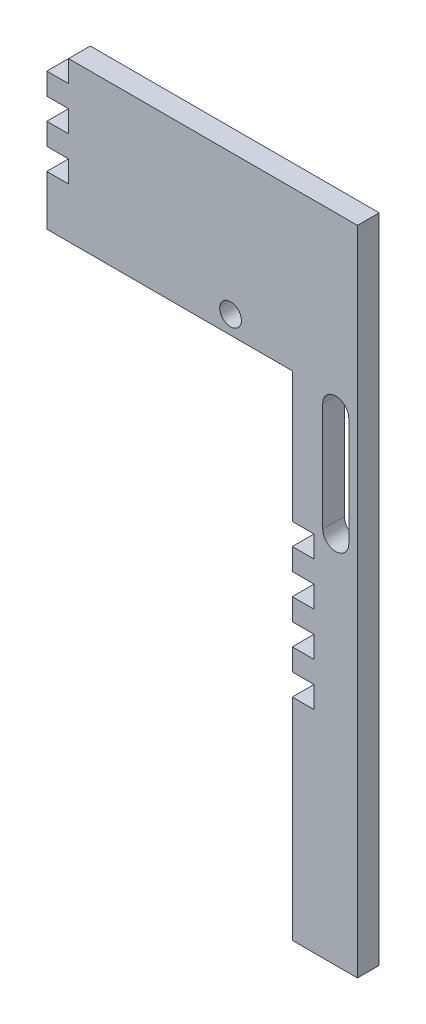
ISO-10303-21;
HEADER;
FILE_DESCRIPTION(('STEP AP214'),'2;1');
FILE_NAME('part.step','',(''),(''),'','','');
FILE_SCHEMA(('AUTOMOTIVE_DESIGN { 1 0 10303 214 1 1 1 1 }'));
ENDSEC;
DATA;
#1=APPLICATION_CONTEXT('core data for automotive mechanical design processes');
#2=APPLICATION_PROTOCOL_DEFINITION('international standard','automotive_design',2000,#1);
#3=PRODUCT_CONTEXT('',#1,'mechanical');
#4=PRODUCT('Part','Part','',(#3));
#5=PRODUCT_RELATED_PRODUCT_CATEGORY('part','',(#4));
#6=PRODUCT_DEFINITION_FORMATION('','',#4);
#7=PRODUCT_DEFINITION_CONTEXT('part definition',#1,'design');
#8=PRODUCT_DEFINITION('design','',#6,#7);
#9=PRODUCT_DEFINITION_SHAPE('','',#8);
#10=(LENGTH_UNIT() NAMED_UNIT(*) SI_UNIT(.MILLI.,.METRE.));
#11=(NAMED_UNIT(*) PLANE_ANGLE_UNIT() SI_UNIT($,.RADIAN.));
#12=(NAMED_UNIT(*) SI_UNIT($,.STERADIAN.) SOLID_ANGLE_UNIT());
#13=UNCERTAINTY_MEASURE_WITH_UNIT(LENGTH_MEASURE(1.E-05),#10,'distance_accuracy_value','');
#14=(GEOMETRIC_REPRESENTATION_CONTEXT(3) GLOBAL_UNCERTAINTY_ASSIGNED_CONTEXT((#13)) GLOBAL_UNIT_ASSIGNED_CONTEXT((#10,
#11,#12)) REPRESENTATION_CONTEXT('',''));
#15=CARTESIAN_POINT('',(0.,0.,0.));
#16=DIRECTION('',(0.,0.,1.));
#17=DIRECTION('',(1.,0.,0.));
#18=AXIS2_PLACEMENT_3D('',#15,#16,#17);
#19=CARTESIAN_POINT('',(-30.,0.,10.));
#20=DIRECTION('',(1.,0.,0.));
#21=DIRECTION('',(0.,0.,-1.));
#22=AXIS2_PLACEMENT_3D('',#19,#20,#21);
#23=PLANE('',#22);
#24=DIRECTION('',(0.,-1.,0.));
#25=VECTOR('',#24,1.);
#26=CARTESIAN_POINT('',(-30.,0.,0.));
#27=LINE('',#26,#25);
#28=CARTESIAN_POINT('',(-30.,117.,0.));
#29=VERTEX_POINT('',#28);
#30=CARTESIAN_POINT('',(-30.,107.,0.));
#31=VERTEX_POINT('',#30);
#32=EDGE_CURVE('E617',#29,#31,#27,.T.);
#33=ORIENTED_EDGE('',*,*,#32,.T.);
#34=DIRECTION('',(0.,0.,1.));
#35=VECTOR('',#34,1.);
#36=CARTESIAN_POINT('',(-30.,107.,0.));
#37=LINE('',#36,#35);
#38=CARTESIAN_POINT('',(-30.,107.,10.));
#39=VERTEX_POINT('',#38);
#40=EDGE_CURVE('E324',#31,#39,#37,.T.);
#41=ORIENTED_EDGE('',*,*,#40,.T.);
#42=DIRECTION('',(0.,-1.,0.));
#43=VECTOR('',#42,1.);
#44=CARTESIAN_POINT('',(-30.,0.,10.));
#45=LINE('',#44,#43);
#46=CARTESIAN_POINT('',(-30.,117.,10.));
#47=VERTEX_POINT('',#46);
#48=EDGE_CURVE('E635',#47,#39,#45,.T.);
#49=ORIENTED_EDGE('',*,*,#48,.F.);
#50=DIRECTION('',(0.,0.,1.));
#51=VECTOR('',#50,1.);
#52=CARTESIAN_POINT('',(-30.,117.,0.));
#53=LINE('',#52,#51);
#54=EDGE_CURVE('E343',#29,#47,#53,.T.);
#55=ORIENTED_EDGE('',*,*,#54,.F.);
#56=EDGE_LOOP('',(#33,#41,#49,#55));
#57=FACE_BOUND('',#56,.T.);
#58=ADVANCED_FACE('F33',(#57),#23,.F.);
#59=CARTESIAN_POINT('',(-30.,137.,0.));
#60=VERTEX_POINT('',#59);
#61=CARTESIAN_POINT('',(-30.,127.,0.));
#62=VERTEX_POINT('',#61);
#63=EDGE_CURVE('E615',#60,#62,#27,.T.);
#64=ORIENTED_EDGE('',*,*,#63,.T.);
#65=DIRECTION('',(0.,0.,1.));
#66=VECTOR('',#65,1.);
#67=CARTESIAN_POINT('',(-30.,127.,0.));
#68=LINE('',#67,#66);
#69=CARTESIAN_POINT('',(-30.,127.,10.));
#70=VERTEX_POINT('',#69);
#71=EDGE_CURVE('E350',#62,#70,#68,.T.);
#72=ORIENTED_EDGE('',*,*,#71,.T.);
#73=CARTESIAN_POINT('',(-30.,137.,10.));
#74=VERTEX_POINT('',#73);
#75=EDGE_CURVE('E637',#74,#70,#45,.T.);
#76=ORIENTED_EDGE('',*,*,#75,.F.);
#77=DIRECTION('',(0.,0.,1.));
#78=VECTOR('',#77,1.);
#79=CARTESIAN_POINT('',(-30.,137.,0.));
#80=LINE('',#79,#78);
#81=EDGE_CURVE('E369',#60,#74,#80,.T.);
#82=ORIENTED_EDGE('',*,*,#81,.F.);
#83=EDGE_LOOP('',(#64,#72,#76,#82));
#84=FACE_BOUND('',#83,.T.);
#85=ADVANCED_FACE('F585',(#84),#23,.F.);
#86=CARTESIAN_POINT('',(-30.,157.,0.));
#87=VERTEX_POINT('',#86);
#88=CARTESIAN_POINT('',(-30.,147.,0.));
#89=VERTEX_POINT('',#88);
#90=EDGE_CURVE('E519',#87,#89,#27,.T.);
#91=ORIENTED_EDGE('',*,*,#90,.T.);
#92=DIRECTION('',(0.,0.,1.));
#93=VECTOR('',#92,1.);
#94=CARTESIAN_POINT('',(-30.,147.,0.));
#95=LINE('',#94,#93);
#96=CARTESIAN_POINT('',(-30.,147.,10.));
#97=VERTEX_POINT('',#96);
#98=EDGE_CURVE('E376',#89,#97,#95,.T.);
#99=ORIENTED_EDGE('',*,*,#98,.T.);
#100=CARTESIAN_POINT('',(-30.,157.,10.));
#101=VERTEX_POINT('',#100);
#102=EDGE_CURVE('E500',#101,#97,#45,.T.);
#103=ORIENTED_EDGE('',*,*,#102,.F.);
#104=DIRECTION('',(0.,0.,1.));
#105=VECTOR('',#104,1.);
#106=CARTESIAN_POINT('',(-30.,157.,0.));
#107=LINE('',#106,#105);
#108=EDGE_CURVE('E395',#87,#101,#107,.T.);
#109=ORIENTED_EDGE('',*,*,#108,.F.);
#110=EDGE_LOOP('',(#91,#99,#103,#109));
#111=FACE_BOUND('',#110,.T.);
#112=ADVANCED_FACE('F591',(#111),#23,.F.);
#113=CARTESIAN_POINT('',(-30.,227.,0.));
#114=VERTEX_POINT('',#113);
#115=CARTESIAN_POINT('',(-30.,167.,0.));
#116=VERTEX_POINT('',#115);
#117=EDGE_CURVE('E516',#114,#116,#27,.T.);
#118=ORIENTED_EDGE('',*,*,#117,.T.);
#119=DIRECTION('',(0.,0.,1.));
#120=VECTOR('',#119,1.);
#121=CARTESIAN_POINT('',(-30.,167.,0.));
#122=LINE('',#121,#120);
#123=CARTESIAN_POINT('',(-30.,167.,10.));
#124=VERTEX_POINT('',#123);
#125=EDGE_CURVE('E402',#116,#124,#122,.T.);
#126=ORIENTED_EDGE('',*,*,#125,.T.);
#127=CARTESIAN_POINT('',(-30.,227.,10.));
#128=VERTEX_POINT('',#127);
#129=EDGE_CURVE('E496',#128,#124,#45,.T.);
#130=ORIENTED_EDGE('',*,*,#129,.F.);
#131=DIRECTION('',(0.,0.,-1.));
#132=VECTOR('',#131,1.);
#133=CARTESIAN_POINT('',(-30.,227.,10.));
#134=LINE('',#133,#132);
#135=EDGE_CURVE('E526',#128,#114,#134,.T.);
#136=ORIENTED_EDGE('',*,*,#135,.T.);
#137=EDGE_LOOP('',(#118,#126,#130,#136));
#138=FACE_BOUND('',#137,.T.);
#139=ADVANCED_FACE('F541',(#138),#23,.F.);
#140=CARTESIAN_POINT('',(-143.,227.,10.));
#141=DIRECTION('',(1.,0.,0.));
#142=DIRECTION('',(0.,1.,0.));
#143=AXIS2_PLACEMENT_3D('',#140,#141,#142);
#144=PLANE('',#143);
#145=DIRECTION('',(0.,-1.,0.));
#146=VECTOR('',#145,1.);
#147=CARTESIAN_POINT('',(-143.,227.,0.));
#148=LINE('',#147,#146);
#149=CARTESIAN_POINT('',(-143.,270.,0.));
#150=VERTEX_POINT('',#149);
#151=CARTESIAN_POINT('',(-143.,260.,0.));
#152=VERTEX_POINT('',#151);
#153=EDGE_CURVE('E513',#150,#152,#148,.T.);
#154=ORIENTED_EDGE('',*,*,#153,.T.);
#155=DIRECTION('',(0.,0.,1.));
#156=VECTOR('',#155,1.);
#157=CARTESIAN_POINT('',(-143.,260.,0.));
#158=LINE('',#157,#156);
#159=CARTESIAN_POINT('',(-143.,260.,10.));
#160=VERTEX_POINT('',#159);
#161=EDGE_CURVE('E428',#152,#160,#158,.T.);
#162=ORIENTED_EDGE('',*,*,#161,.T.);
#163=DIRECTION('',(0.,-1.,0.));
#164=VECTOR('',#163,1.);
#165=CARTESIAN_POINT('',(-143.,227.,10.));
#166=LINE('',#165,#164);
#167=CARTESIAN_POINT('',(-143.,270.,10.));
#168=VERTEX_POINT('',#167);
#169=EDGE_CURVE('E493',#168,#160,#166,.T.);
#170=ORIENTED_EDGE('',*,*,#169,.F.);
#171=DIRECTION('',(0.,0.,1.));
#172=VECTOR('',#171,1.);
#173=CARTESIAN_POINT('',(-143.,270.,0.));
#174=LINE('',#173,#172);
#175=EDGE_CURVE('E447',#150,#168,#174,.T.);
#176=ORIENTED_EDGE('',*,*,#175,.F.);
#177=EDGE_LOOP('',(#154,#162,#170,#176));
#178=FACE_BOUND('',#177,.T.);
#179=ADVANCED_FACE('F559',(#178),#144,.F.);
#180=CARTESIAN_POINT('',(-143.,290.,0.));
#181=VERTEX_POINT('',#180);
#182=CARTESIAN_POINT('',(-143.,280.,0.));
#183=VERTEX_POINT('',#182);
#184=EDGE_CURVE('E509',#181,#183,#148,.T.);
#185=ORIENTED_EDGE('',*,*,#184,.T.);
#186=DIRECTION('',(0.,0.,1.));
#187=VECTOR('',#186,1.);
#188=CARTESIAN_POINT('',(-143.,280.,0.));
#189=LINE('',#188,#187);
#190=CARTESIAN_POINT('',(-143.,280.,10.));
#191=VERTEX_POINT('',#190);
#192=EDGE_CURVE('E454',#183,#191,#189,.T.);
#193=ORIENTED_EDGE('',*,*,#192,.T.);
#194=CARTESIAN_POINT('',(-143.,290.,10.));
#195=VERTEX_POINT('',#194);
#196=EDGE_CURVE('E489',#195,#191,#166,.T.);
#197=ORIENTED_EDGE('',*,*,#196,.F.);
#198=DIRECTION('',(0.,0.,1.));
#199=VECTOR('',#198,1.);
#200=CARTESIAN_POINT('',(-143.,290.,0.));
#201=LINE('',#200,#199);
#202=EDGE_CURVE('E470',#181,#195,#201,.T.);
#203=ORIENTED_EDGE('',*,*,#202,.F.);
#204=EDGE_LOOP('',(#185,#193,#197,#203));
#205=FACE_BOUND('',#204,.T.);
#206=ADVANCED_FACE('F573',(#205),#144,.F.);
#207=CARTESIAN_POINT('',(0.,0.,10.));
#208=DIRECTION('',(-1.,0.,0.));
#209=DIRECTION('',(0.,0.,1.));
#210=AXIS2_PLACEMENT_3D('',#207,#208,#209);
#211=PLANE('',#210);
#212=DIRECTION('',(0.,1.,0.));
#213=VECTOR('',#212,1.);
#214=CARTESIAN_POINT('',(0.,0.,0.));
#215=LINE('',#214,#213);
#216=CARTESIAN_POINT('',(0.,0.,0.));
#217=VERTEX_POINT('',#216);
#218=CARTESIAN_POINT('',(0.,300.,0.));
#219=VERTEX_POINT('',#218);
#220=EDGE_CURVE('E477',#217,#219,#215,.T.);
#221=ORIENTED_EDGE('',*,*,#220,.T.);
#222=DIRECTION('',(0.,0.,-1.));
#223=VECTOR('',#222,1.);
#224=CARTESIAN_POINT('',(0.,300.,10.));
#225=LINE('',#224,#223);
#226=CARTESIAN_POINT('',(0.,300.,10.));
#227=VERTEX_POINT('',#226);
#228=EDGE_CURVE('E11',#227,#219,#225,.T.);
#229=ORIENTED_EDGE('',*,*,#228,.F.);
#230=DIRECTION('',(0.,1.,0.));
#231=VECTOR('',#230,1.);
#232=CARTESIAN_POINT('',(0.,0.,10.));
#233=LINE('',#232,#231);
#234=CARTESIAN_POINT('',(0.,0.,10.));
#235=VERTEX_POINT('',#234);
#236=EDGE_CURVE('E481',#235,#227,#233,.T.);
#237=ORIENTED_EDGE('',*,*,#236,.F.);
#238=DIRECTION('',(0.,0.,-1.));
#239=VECTOR('',#238,1.);
#240=CARTESIAN_POINT('',(0.,0.,10.));
#241=LINE('',#240,#239);
#242=EDGE_CURVE('E502',#235,#217,#241,.T.);
#243=ORIENTED_EDGE('',*,*,#242,.T.);
#244=EDGE_LOOP('',(#221,#229,#237,#243));
#245=FACE_BOUND('',#244,.T.);
#246=ADVANCED_FACE('F35',(#245),#211,.F.);
#247=CARTESIAN_POINT('',(0.,300.,10.));
#248=DIRECTION('',(0.,-1.,0.));
#249=DIRECTION('',(0.,0.,-1.));
#250=AXIS2_PLACEMENT_3D('',#247,#248,#249);
#251=PLANE('',#250);
#252=DIRECTION('',(-1.,0.,0.));
#253=VECTOR('',#252,1.);
#254=CARTESIAN_POINT('',(0.,300.,0.));
#255=LINE('',#254,#253);
#256=CARTESIAN_POINT('',(-133.,300.,0.));
#257=VERTEX_POINT('',#256);
#258=EDGE_CURVE('E505',#219,#257,#255,.T.);
#259=ORIENTED_EDGE('',*,*,#258,.T.);
#260=DIRECTION('',(0.,0.,1.));
#261=VECTOR('',#260,1.);
#262=CARTESIAN_POINT('',(-133.,300.,0.));
#263=LINE('',#262,#261);
#264=CARTESIAN_POINT('',(-133.,300.,10.));
#265=VERTEX_POINT('',#264);
#266=EDGE_CURVE('E474',#257,#265,#263,.T.);
#267=ORIENTED_EDGE('',*,*,#266,.T.);
#268=DIRECTION('',(-1.,0.,0.));
#269=VECTOR('',#268,1.);
#270=CARTESIAN_POINT('',(0.,300.,10.));
#271=LINE('',#270,#269);
#272=EDGE_CURVE('E484',#227,#265,#271,.T.);
#273=ORIENTED_EDGE('',*,*,#272,.F.);
#274=ORIENTED_EDGE('',*,*,#228,.T.);
#275=EDGE_LOOP('',(#259,#267,#273,#274));
#276=FACE_BOUND('',#275,.T.);
#277=ADVANCED_FACE('F571',(#276),#251,.F.);
#278=CARTESIAN_POINT('',(-143.,250.,10.));
#279=VERTEX_POINT('',#278);
#280=CARTESIAN_POINT('',(-143.,227.,10.));
#281=VERTEX_POINT('',#280);
#282=EDGE_CURVE('E488',#279,#281,#166,.T.);
#283=ORIENTED_EDGE('',*,*,#282,.F.);
#284=DIRECTION('',(0.,0.,1.));
#285=VECTOR('',#284,1.);
#286=CARTESIAN_POINT('',(-143.,250.,0.));
#287=LINE('',#286,#285);
#288=CARTESIAN_POINT('',(-143.,250.,0.));
#289=VERTEX_POINT('',#288);
#290=EDGE_CURVE('E421',#289,#279,#287,.T.);
#291=ORIENTED_EDGE('',*,*,#290,.F.);
#292=CARTESIAN_POINT('',(-143.,227.,0.));
#293=VERTEX_POINT('',#292);
#294=EDGE_CURVE('E508',#289,#293,#148,.T.);
#295=ORIENTED_EDGE('',*,*,#294,.T.);
#296=DIRECTION('',(0.,0.,-1.));
#297=VECTOR('',#296,1.);
#298=CARTESIAN_POINT('',(-143.,227.,10.));
#299=LINE('',#298,#297);
#300=EDGE_CURVE('E41',#281,#293,#299,.T.);
#301=ORIENTED_EDGE('',*,*,#300,.F.);
#302=EDGE_LOOP('',(#283,#291,#295,#301));
#303=FACE_BOUND('',#302,.T.);
#304=ADVANCED_FACE('F569',(#303),#144,.F.);
#305=CARTESIAN_POINT('',(-30.,227.,10.));
#306=DIRECTION('',(0.,1.,0.));
#307=DIRECTION('',(0.,0.,1.));
#308=AXIS2_PLACEMENT_3D('',#305,#306,#307);
#309=PLANE('',#308);
#310=DIRECTION('',(1.,0.,0.));
#311=VECTOR('',#310,1.);
#312=CARTESIAN_POINT('',(-30.,227.,0.));
#313=LINE('',#312,#311);
#314=EDGE_CURVE('E512',#293,#114,#313,.T.);
#315=ORIENTED_EDGE('',*,*,#314,.T.);
#316=ORIENTED_EDGE('',*,*,#135,.F.);
#317=DIRECTION('',(1.,0.,0.));
#318=VECTOR('',#317,1.);
#319=CARTESIAN_POINT('',(-30.,227.,10.));
#320=LINE('',#319,#318);
#321=EDGE_CURVE('E492',#281,#128,#320,.T.);
#322=ORIENTED_EDGE('',*,*,#321,.F.);
#323=ORIENTED_EDGE('',*,*,#300,.T.);
#324=EDGE_LOOP('',(#315,#316,#322,#323));
#325=FACE_BOUND('',#324,.T.);
#326=ADVANCED_FACE('F533',(#325),#309,.F.);
#327=CARTESIAN_POINT('',(-30.,97.,10.));
#328=VERTEX_POINT('',#327);
#329=CARTESIAN_POINT('',(-30.,0.,10.));
#330=VERTEX_POINT('',#329);
#331=EDGE_CURVE('E495',#328,#330,#45,.T.);
#332=ORIENTED_EDGE('',*,*,#331,.F.);
#333=DIRECTION('',(0.,0.,1.));
#334=VECTOR('',#333,1.);
#335=CARTESIAN_POINT('',(-30.,97.,0.));
#336=LINE('',#335,#334);
#337=CARTESIAN_POINT('',(-30.,97.,0.));
#338=VERTEX_POINT('',#337);
#339=EDGE_CURVE('E317',#338,#328,#336,.T.);
#340=ORIENTED_EDGE('',*,*,#339,.F.);
#341=CARTESIAN_POINT('',(-30.,0.,0.));
#342=VERTEX_POINT('',#341);
#343=EDGE_CURVE('E515',#338,#342,#27,.T.);
#344=ORIENTED_EDGE('',*,*,#343,.T.);
#345=DIRECTION('',(0.,0.,-1.));
#346=VECTOR('',#345,1.);
#347=CARTESIAN_POINT('',(-30.,0.,10.));
#348=LINE('',#347,#346);
#349=EDGE_CURVE('E523',#330,#342,#348,.T.);
#350=ORIENTED_EDGE('',*,*,#349,.F.);
#351=EDGE_LOOP('',(#332,#340,#344,#350));
#352=FACE_BOUND('',#351,.T.);
#353=ADVANCED_FACE('F578',(#352),#23,.F.);
#354=CARTESIAN_POINT('',(0.,0.,10.));
#355=DIRECTION('',(0.,1.,0.));
#356=DIRECTION('',(-1.,0.,0.));
#357=AXIS2_PLACEMENT_3D('',#354,#355,#356);
#358=PLANE('',#357);
#359=DIRECTION('',(1.,0.,0.));
#360=VECTOR('',#359,1.);
#361=CARTESIAN_POINT('',(0.,0.,0.));
#362=LINE('',#361,#360);
#363=EDGE_CURVE('E485',#342,#217,#362,.T.);
#364=ORIENTED_EDGE('',*,*,#363,.T.);
#365=ORIENTED_EDGE('',*,*,#242,.F.);
#366=DIRECTION('',(1.,0.,0.));
#367=VECTOR('',#366,1.);
#368=CARTESIAN_POINT('',(0.,0.,10.));
#369=LINE('',#368,#367);
#370=EDGE_CURVE('E499',#330,#235,#369,.T.);
#371=ORIENTED_EDGE('',*,*,#370,.F.);
#372=ORIENTED_EDGE('',*,*,#349,.T.);
#373=EDGE_LOOP('',(#364,#365,#371,#372));
#374=FACE_BOUND('',#373,.T.);
#375=ADVANCED_FACE('F596',(#374),#358,.F.);
#376=CARTESIAN_POINT('',(0.,0.,10.));
#377=DIRECTION('',(0.,0.,1.));
#378=DIRECTION('',(1.,0.,0.));
#379=AXIS2_PLACEMENT_3D('',#376,#377,#378);
#380=PLANE('',#379);
#381=CARTESIAN_POINT('',(-58.4159264927315,235.370461513675,10.));
#382=DIRECTION('',(0.,0.,1.));
#383=DIRECTION('',(1.,0.,0.));
#384=AXIS2_PLACEMENT_3D('',#381,#382,#383);
#385=CIRCLE('',#384,5.);
#386=CARTESIAN_POINT('',(-53.4159264927315,235.370461513675,10.));
#387=VERTEX_POINT('',#386);
#388=EDGE_CURVE('E290',#387,#387,#385,.T.);
#389=ORIENTED_EDGE('',*,*,#388,.F.);
#390=EDGE_LOOP('',(#389));
#391=FACE_BOUND('',#390,.T.);
#392=CARTESIAN_POINT('',(-10.,221.,10.));
#393=DIRECTION('',(0.,0.,1.));
#394=DIRECTION('',(-1.,0.,0.));
#395=AXIS2_PLACEMENT_3D('',#392,#393,#394);
#396=CIRCLE('',#395,5.99999999999999);
#397=CARTESIAN_POINT('',(-4.,221.,10.));
#398=VERTEX_POINT('',#397);
#399=CARTESIAN_POINT('',(-16.,221.,10.));
#400=VERTEX_POINT('',#399);
#401=EDGE_CURVE('E48',#398,#400,#396,.T.);
#402=ORIENTED_EDGE('',*,*,#401,.F.);
#403=DIRECTION('',(0.,1.,0.));
#404=VECTOR('',#403,1.);
#405=CARTESIAN_POINT('',(-4.,221.,10.));
#406=LINE('',#405,#404);
#407=CARTESIAN_POINT('',(-3.99999999999999,171.,10.));
#408=VERTEX_POINT('',#407);
#409=EDGE_CURVE('E284',#408,#398,#406,.T.);
#410=ORIENTED_EDGE('',*,*,#409,.F.);
#411=CARTESIAN_POINT('',(-9.99999999999999,171.,10.));
#412=DIRECTION('',(0.,0.,1.));
#413=DIRECTION('',(1.,0.,0.));
#414=AXIS2_PLACEMENT_3D('',#411,#412,#413);
#415=CIRCLE('',#414,6.);
#416=CARTESIAN_POINT('',(-16.,171.,10.));
#417=VERTEX_POINT('',#416);
#418=EDGE_CURVE('E287',#417,#408,#415,.T.);
#419=ORIENTED_EDGE('',*,*,#418,.F.);
#420=DIRECTION('',(0.,-1.,0.));
#421=VECTOR('',#420,1.);
#422=CARTESIAN_POINT('',(-16.,171.,10.));
#423=LINE('',#422,#421);
#424=EDGE_CURVE('E296',#400,#417,#423,.T.);
#425=ORIENTED_EDGE('',*,*,#424,.F.);
#426=EDGE_LOOP('',(#402,#410,#419,#425));
#427=FACE_BOUND('',#426,.T.);
#428=DIRECTION('',(-1.,0.,0.));
#429=VECTOR('',#428,1.);
#430=CARTESIAN_POINT('',(-30.,107.,10.));
#431=LINE('',#430,#429);
#432=CARTESIAN_POINT('',(-20.,107.,10.));
#433=VERTEX_POINT('',#432);
#434=EDGE_CURVE('E311',#433,#39,#431,.T.);
#435=ORIENTED_EDGE('',*,*,#434,.F.);
#436=DIRECTION('',(0.,1.,0.));
#437=VECTOR('',#436,1.);
#438=CARTESIAN_POINT('',(-20.,107.,10.));
#439=LINE('',#438,#437);
#440=CARTESIAN_POINT('',(-20.,97.,10.));
#441=VERTEX_POINT('',#440);
#442=EDGE_CURVE('E320',#441,#433,#439,.T.);
#443=ORIENTED_EDGE('',*,*,#442,.F.);
#444=DIRECTION('',(1.,0.,0.));
#445=VECTOR('',#444,1.);
#446=CARTESIAN_POINT('',(-30.,97.,10.));
#447=LINE('',#446,#445);
#448=EDGE_CURVE('E303',#328,#441,#447,.T.);
#449=ORIENTED_EDGE('',*,*,#448,.F.);
#450=ORIENTED_EDGE('',*,*,#331,.T.);
#451=ORIENTED_EDGE('',*,*,#370,.T.);
#452=ORIENTED_EDGE('',*,*,#236,.T.);
#453=ORIENTED_EDGE('',*,*,#272,.T.);
#454=DIRECTION('',(0.,1.,0.));
#455=VECTOR('',#454,1.);
#456=CARTESIAN_POINT('',(-133.,300.,10.));
#457=LINE('',#456,#455);
#458=CARTESIAN_POINT('',(-133.,290.,10.));
#459=VERTEX_POINT('',#458);
#460=EDGE_CURVE('E467',#459,#265,#457,.T.);
#461=ORIENTED_EDGE('',*,*,#460,.F.);
#462=DIRECTION('',(1.,0.,0.));
#463=VECTOR('',#462,1.);
#464=CARTESIAN_POINT('',(-143.,290.,10.));
#465=LINE('',#464,#463);
#466=EDGE_CURVE('E457',#195,#459,#465,.T.);
#467=ORIENTED_EDGE('',*,*,#466,.F.);
#468=ORIENTED_EDGE('',*,*,#196,.T.);
#469=DIRECTION('',(-1.,0.,0.));
#470=VECTOR('',#469,1.);
#471=CARTESIAN_POINT('',(-143.,280.,10.));
#472=LINE('',#471,#470);
#473=CARTESIAN_POINT('',(-133.,280.,10.));
#474=VERTEX_POINT('',#473);
#475=EDGE_CURVE('E441',#474,#191,#472,.T.);
#476=ORIENTED_EDGE('',*,*,#475,.F.);
#477=DIRECTION('',(0.,1.,0.));
#478=VECTOR('',#477,1.);
#479=CARTESIAN_POINT('',(-133.,280.,10.));
#480=LINE('',#479,#478);
#481=CARTESIAN_POINT('',(-133.,270.,10.));
#482=VERTEX_POINT('',#481);
#483=EDGE_CURVE('E450',#482,#474,#480,.T.);
#484=ORIENTED_EDGE('',*,*,#483,.F.);
#485=DIRECTION('',(1.,0.,0.));
#486=VECTOR('',#485,1.);
#487=CARTESIAN_POINT('',(-143.,270.,10.));
#488=LINE('',#487,#486);
#489=EDGE_CURVE('E431',#168,#482,#488,.T.);
#490=ORIENTED_EDGE('',*,*,#489,.F.);
#491=ORIENTED_EDGE('',*,*,#169,.T.);
#492=DIRECTION('',(-1.,0.,0.));
#493=VECTOR('',#492,1.);
#494=CARTESIAN_POINT('',(-143.,260.,10.));
#495=LINE('',#494,#493);
#496=CARTESIAN_POINT('',(-133.,260.,10.));
#497=VERTEX_POINT('',#496);
#498=EDGE_CURVE('E415',#497,#160,#495,.T.);
#499=ORIENTED_EDGE('',*,*,#498,.F.);
#500=DIRECTION('',(0.,1.,0.));
#501=VECTOR('',#500,1.);
#502=CARTESIAN_POINT('',(-133.,260.,10.));
#503=LINE('',#502,#501);
#504=CARTESIAN_POINT('',(-133.,250.,10.));
#505=VERTEX_POINT('',#504);
#506=EDGE_CURVE('E424',#505,#497,#503,.T.);
#507=ORIENTED_EDGE('',*,*,#506,.F.);
#508=DIRECTION('',(1.,0.,0.));
#509=VECTOR('',#508,1.);
#510=CARTESIAN_POINT('',(-143.,250.,10.));
#511=LINE('',#510,#509);
#512=EDGE_CURVE('E405',#279,#505,#511,.T.);
#513=ORIENTED_EDGE('',*,*,#512,.F.);
#514=ORIENTED_EDGE('',*,*,#282,.T.);
#515=ORIENTED_EDGE('',*,*,#321,.T.);
#516=ORIENTED_EDGE('',*,*,#129,.T.);
#517=DIRECTION('',(-1.,0.,0.));
#518=VECTOR('',#517,1.);
#519=CARTESIAN_POINT('',(-30.,167.,10.));
#520=LINE('',#519,#518);
#521=CARTESIAN_POINT('',(-20.,167.,10.));
#522=VERTEX_POINT('',#521);
#523=EDGE_CURVE('E389',#522,#124,#520,.T.);
#524=ORIENTED_EDGE('',*,*,#523,.F.);
#525=DIRECTION('',(0.,1.,0.));
#526=VECTOR('',#525,1.);
#527=CARTESIAN_POINT('',(-20.,167.,10.));
#528=LINE('',#527,#526);
#529=CARTESIAN_POINT('',(-20.,157.,10.));
#530=VERTEX_POINT('',#529);
#531=EDGE_CURVE('E398',#530,#522,#528,.T.);
#532=ORIENTED_EDGE('',*,*,#531,.F.);
#533=DIRECTION('',(1.,0.,0.));
#534=VECTOR('',#533,1.);
#535=CARTESIAN_POINT('',(-30.,157.,10.));
#536=LINE('',#535,#534);
#537=EDGE_CURVE('E379',#101,#530,#536,.T.);
#538=ORIENTED_EDGE('',*,*,#537,.F.);
#539=ORIENTED_EDGE('',*,*,#102,.T.);
#540=DIRECTION('',(-1.,0.,0.));
#541=VECTOR('',#540,1.);
#542=CARTESIAN_POINT('',(-30.,147.,10.));
#543=LINE('',#542,#541);
#544=CARTESIAN_POINT('',(-20.,147.,10.));
#545=VERTEX_POINT('',#544);
#546=EDGE_CURVE('E363',#545,#97,#543,.T.);
#547=ORIENTED_EDGE('',*,*,#546,.F.);
#548=DIRECTION('',(0.,1.,0.));
#549=VECTOR('',#548,1.);
#550=CARTESIAN_POINT('',(-20.,147.,10.));
#551=LINE('',#550,#549);
#552=CARTESIAN_POINT('',(-20.,137.,10.));
#553=VERTEX_POINT('',#552);
#554=EDGE_CURVE('E372',#553,#545,#551,.T.);
#555=ORIENTED_EDGE('',*,*,#554,.F.);
#556=DIRECTION('',(1.,0.,0.));
#557=VECTOR('',#556,1.);
#558=CARTESIAN_POINT('',(-30.,137.,10.));
#559=LINE('',#558,#557);
#560=EDGE_CURVE('E353',#74,#553,#559,.T.);
#561=ORIENTED_EDGE('',*,*,#560,.F.);
#562=ORIENTED_EDGE('',*,*,#75,.T.);
#563=DIRECTION('',(-1.,0.,0.));
#564=VECTOR('',#563,1.);
#565=CARTESIAN_POINT('',(-30.,127.,10.));
#566=LINE('',#565,#564);
#567=CARTESIAN_POINT('',(-20.,127.,10.));
#568=VERTEX_POINT('',#567);
#569=EDGE_CURVE('E337',#568,#70,#566,.T.);
#570=ORIENTED_EDGE('',*,*,#569,.F.);
#571=DIRECTION('',(0.,1.,0.));
#572=VECTOR('',#571,1.);
#573=CARTESIAN_POINT('',(-20.,127.,10.));
#574=LINE('',#573,#572);
#575=CARTESIAN_POINT('',(-20.,117.,10.));
#576=VERTEX_POINT('',#575);
#577=EDGE_CURVE('E346',#576,#568,#574,.T.);
#578=ORIENTED_EDGE('',*,*,#577,.F.);
#579=DIRECTION('',(1.,0.,0.));
#580=VECTOR('',#579,1.);
#581=CARTESIAN_POINT('',(-30.,117.,10.));
#582=LINE('',#581,#580);
#583=EDGE_CURVE('E327',#47,#576,#582,.T.);
#584=ORIENTED_EDGE('',*,*,#583,.F.);
#585=ORIENTED_EDGE('',*,*,#48,.T.);
#586=EDGE_LOOP('',(#435,#443,#449,#450,#451,#452,#453,#461,#467,#468,#476,#484,#490,#491,#499,
#507,#513,#514,#515,#516,#524,#532,#538,#539,#547,#555,#561,#562,#570,#578,#584,#585));
#587=FACE_BOUND('',#586,.T.);
#588=ADVANCED_FACE('F546',(#391,#427,#587),#380,.T.);
#589=CARTESIAN_POINT('',(0.,0.,0.));
#590=DIRECTION('',(0.,0.,1.));
#591=DIRECTION('',(1.,0.,0.));
#592=AXIS2_PLACEMENT_3D('',#589,#590,#591);
#593=PLANE('',#592);
#594=CARTESIAN_POINT('',(-58.4159264927315,235.370461513675,0.));
#595=DIRECTION('',(0.,0.,1.));
#596=DIRECTION('',(1.,0.,0.));
#597=AXIS2_PLACEMENT_3D('',#594,#595,#596);
#598=CIRCLE('',#597,5.);
#599=CARTESIAN_POINT('',(-53.4159264927315,235.370461513675,0.));
#600=VERTEX_POINT('',#599);
#601=EDGE_CURVE('E297',#600,#600,#598,.T.);
#602=ORIENTED_EDGE('',*,*,#601,.T.);
#603=EDGE_LOOP('',(#602));
#604=FACE_BOUND('',#603,.T.);
#605=DIRECTION('',(0.,1.,0.));
#606=VECTOR('',#605,1.);
#607=CARTESIAN_POINT('',(-4.,221.,0.));
#608=LINE('',#607,#606);
#609=CARTESIAN_POINT('',(-3.99999999999999,171.,0.));
#610=VERTEX_POINT('',#609);
#611=CARTESIAN_POINT('',(-4.,221.,0.));
#612=VERTEX_POINT('',#611);
#613=EDGE_CURVE('E274',#610,#612,#608,.T.);
#614=ORIENTED_EDGE('',*,*,#613,.T.);
#615=CARTESIAN_POINT('',(-10.,221.,0.));
#616=DIRECTION('',(0.,0.,1.));
#617=DIRECTION('',(-1.,0.,0.));
#618=AXIS2_PLACEMENT_3D('',#615,#616,#617);
#619=CIRCLE('',#618,5.99999999999999);
#620=CARTESIAN_POINT('',(-16.,221.,0.));
#621=VERTEX_POINT('',#620);
#622=EDGE_CURVE('E268',#612,#621,#619,.T.);
#623=ORIENTED_EDGE('',*,*,#622,.T.);
#624=DIRECTION('',(0.,-1.,0.));
#625=VECTOR('',#624,1.);
#626=CARTESIAN_POINT('',(-16.,171.,0.));
#627=LINE('',#626,#625);
#628=CARTESIAN_POINT('',(-16.,171.,0.));
#629=VERTEX_POINT('',#628);
#630=EDGE_CURVE('E277',#621,#629,#627,.T.);
#631=ORIENTED_EDGE('',*,*,#630,.T.);
#632=CARTESIAN_POINT('',(-9.99999999999999,171.,0.));
#633=DIRECTION('',(0.,0.,1.));
#634=DIRECTION('',(1.,0.,0.));
#635=AXIS2_PLACEMENT_3D('',#632,#633,#634);
#636=CIRCLE('',#635,6.);
#637=EDGE_CURVE('E56',#629,#610,#636,.T.);
#638=ORIENTED_EDGE('',*,*,#637,.T.);
#639=EDGE_LOOP('',(#614,#623,#631,#638));
#640=FACE_BOUND('',#639,.T.);
#641=DIRECTION('',(0.,1.,0.));
#642=VECTOR('',#641,1.);
#643=CARTESIAN_POINT('',(-20.,107.,0.));
#644=LINE('',#643,#642);
#645=CARTESIAN_POINT('',(-20.,97.,0.));
#646=VERTEX_POINT('',#645);
#647=CARTESIAN_POINT('',(-20.,107.,0.));
#648=VERTEX_POINT('',#647);
#649=EDGE_CURVE('E310',#646,#648,#644,.T.);
#650=ORIENTED_EDGE('',*,*,#649,.T.);
#651=DIRECTION('',(-1.,0.,0.));
#652=VECTOR('',#651,1.);
#653=CARTESIAN_POINT('',(-30.,107.,0.));
#654=LINE('',#653,#652);
#655=EDGE_CURVE('E314',#648,#31,#654,.T.);
#656=ORIENTED_EDGE('',*,*,#655,.T.);
#657=ORIENTED_EDGE('',*,*,#32,.F.);
#658=DIRECTION('',(1.,0.,0.));
#659=VECTOR('',#658,1.);
#660=CARTESIAN_POINT('',(-30.,117.,0.));
#661=LINE('',#660,#659);
#662=CARTESIAN_POINT('',(-20.,117.,0.));
#663=VERTEX_POINT('',#662);
#664=EDGE_CURVE('E333',#29,#663,#661,.T.);
#665=ORIENTED_EDGE('',*,*,#664,.T.);
#666=DIRECTION('',(0.,1.,0.));
#667=VECTOR('',#666,1.);
#668=CARTESIAN_POINT('',(-20.,127.,0.));
#669=LINE('',#668,#667);
#670=CARTESIAN_POINT('',(-20.,127.,0.));
#671=VERTEX_POINT('',#670);
#672=EDGE_CURVE('E336',#663,#671,#669,.T.);
#673=ORIENTED_EDGE('',*,*,#672,.T.);
#674=DIRECTION('',(-1.,0.,0.));
#675=VECTOR('',#674,1.);
#676=CARTESIAN_POINT('',(-30.,127.,0.));
#677=LINE('',#676,#675);
#678=EDGE_CURVE('E340',#671,#62,#677,.T.);
#679=ORIENTED_EDGE('',*,*,#678,.T.);
#680=ORIENTED_EDGE('',*,*,#63,.F.);
#681=DIRECTION('',(1.,0.,0.));
#682=VECTOR('',#681,1.);
#683=CARTESIAN_POINT('',(-30.,137.,0.));
#684=LINE('',#683,#682);
#685=CARTESIAN_POINT('',(-20.,137.,0.));
#686=VERTEX_POINT('',#685);
#687=EDGE_CURVE('E359',#60,#686,#684,.T.);
#688=ORIENTED_EDGE('',*,*,#687,.T.);
#689=DIRECTION('',(0.,1.,0.));
#690=VECTOR('',#689,1.);
#691=CARTESIAN_POINT('',(-20.,147.,0.));
#692=LINE('',#691,#690);
#693=CARTESIAN_POINT('',(-20.,147.,0.));
#694=VERTEX_POINT('',#693);
#695=EDGE_CURVE('E362',#686,#694,#692,.T.);
#696=ORIENTED_EDGE('',*,*,#695,.T.);
#697=DIRECTION('',(-1.,0.,0.));
#698=VECTOR('',#697,1.);
#699=CARTESIAN_POINT('',(-30.,147.,0.));
#700=LINE('',#699,#698);
#701=EDGE_CURVE('E366',#694,#89,#700,.T.);
#702=ORIENTED_EDGE('',*,*,#701,.T.);
#703=ORIENTED_EDGE('',*,*,#90,.F.);
#704=DIRECTION('',(1.,0.,0.));
#705=VECTOR('',#704,1.);
#706=CARTESIAN_POINT('',(-30.,157.,0.));
#707=LINE('',#706,#705);
#708=CARTESIAN_POINT('',(-20.,157.,0.));
#709=VERTEX_POINT('',#708);
#710=EDGE_CURVE('E385',#87,#709,#707,.T.);
#711=ORIENTED_EDGE('',*,*,#710,.T.);
#712=DIRECTION('',(0.,1.,0.));
#713=VECTOR('',#712,1.);
#714=CARTESIAN_POINT('',(-20.,167.,0.));
#715=LINE('',#714,#713);
#716=CARTESIAN_POINT('',(-20.,167.,0.));
#717=VERTEX_POINT('',#716);
#718=EDGE_CURVE('E388',#709,#717,#715,.T.);
#719=ORIENTED_EDGE('',*,*,#718,.T.);
#720=DIRECTION('',(-1.,0.,0.));
#721=VECTOR('',#720,1.);
#722=CARTESIAN_POINT('',(-30.,167.,0.));
#723=LINE('',#722,#721);
#724=EDGE_CURVE('E392',#717,#116,#723,.T.);
#725=ORIENTED_EDGE('',*,*,#724,.T.);
#726=ORIENTED_EDGE('',*,*,#117,.F.);
#727=ORIENTED_EDGE('',*,*,#314,.F.);
#728=ORIENTED_EDGE('',*,*,#294,.F.);
#729=DIRECTION('',(1.,0.,0.));
#730=VECTOR('',#729,1.);
#731=CARTESIAN_POINT('',(-143.,250.,0.));
#732=LINE('',#731,#730);
#733=CARTESIAN_POINT('',(-133.,250.,0.));
#734=VERTEX_POINT('',#733);
#735=EDGE_CURVE('E411',#289,#734,#732,.T.);
#736=ORIENTED_EDGE('',*,*,#735,.T.);
#737=DIRECTION('',(0.,1.,0.));
#738=VECTOR('',#737,1.);
#739=CARTESIAN_POINT('',(-133.,260.,0.));
#740=LINE('',#739,#738);
#741=CARTESIAN_POINT('',(-133.,260.,0.));
#742=VERTEX_POINT('',#741);
#743=EDGE_CURVE('E414',#734,#742,#740,.T.);
#744=ORIENTED_EDGE('',*,*,#743,.T.);
#745=DIRECTION('',(-1.,0.,0.));
#746=VECTOR('',#745,1.);
#747=CARTESIAN_POINT('',(-143.,260.,0.));
#748=LINE('',#747,#746);
#749=EDGE_CURVE('E418',#742,#152,#748,.T.);
#750=ORIENTED_EDGE('',*,*,#749,.T.);
#751=ORIENTED_EDGE('',*,*,#153,.F.);
#752=DIRECTION('',(1.,0.,0.));
#753=VECTOR('',#752,1.);
#754=CARTESIAN_POINT('',(-143.,270.,0.));
#755=LINE('',#754,#753);
#756=CARTESIAN_POINT('',(-133.,270.,0.));
#757=VERTEX_POINT('',#756);
#758=EDGE_CURVE('E437',#150,#757,#755,.T.);
#759=ORIENTED_EDGE('',*,*,#758,.T.);
#760=DIRECTION('',(0.,1.,0.));
#761=VECTOR('',#760,1.);
#762=CARTESIAN_POINT('',(-133.,280.,0.));
#763=LINE('',#762,#761);
#764=CARTESIAN_POINT('',(-133.,280.,0.));
#765=VERTEX_POINT('',#764);
#766=EDGE_CURVE('E440',#757,#765,#763,.T.);
#767=ORIENTED_EDGE('',*,*,#766,.T.);
#768=DIRECTION('',(-1.,0.,0.));
#769=VECTOR('',#768,1.);
#770=CARTESIAN_POINT('',(-143.,280.,0.));
#771=LINE('',#770,#769);
#772=EDGE_CURVE('E444',#765,#183,#771,.T.);
#773=ORIENTED_EDGE('',*,*,#772,.T.);
#774=ORIENTED_EDGE('',*,*,#184,.F.);
#775=DIRECTION('',(1.,0.,0.));
#776=VECTOR('',#775,1.);
#777=CARTESIAN_POINT('',(-143.,290.,0.));
#778=LINE('',#777,#776);
#779=CARTESIAN_POINT('',(-133.,290.,0.));
#780=VERTEX_POINT('',#779);
#781=EDGE_CURVE('E463',#181,#780,#778,.T.);
#782=ORIENTED_EDGE('',*,*,#781,.T.);
#783=DIRECTION('',(0.,1.,0.));
#784=VECTOR('',#783,1.);
#785=CARTESIAN_POINT('',(-133.,300.,0.));
#786=LINE('',#785,#784);
#787=EDGE_CURVE('E466',#780,#257,#786,.T.);
#788=ORIENTED_EDGE('',*,*,#787,.T.);
#789=ORIENTED_EDGE('',*,*,#258,.F.);
#790=ORIENTED_EDGE('',*,*,#220,.F.);
#791=ORIENTED_EDGE('',*,*,#363,.F.);
#792=ORIENTED_EDGE('',*,*,#343,.F.);
#793=DIRECTION('',(1.,0.,0.));
#794=VECTOR('',#793,1.);
#795=CARTESIAN_POINT('',(-30.,97.,0.));
#796=LINE('',#795,#794);
#797=EDGE_CURVE('E307',#338,#646,#796,.T.);
#798=ORIENTED_EDGE('',*,*,#797,.T.);
#799=EDGE_LOOP('',(#650,#656,#657,#665,#673,#679,#680,#688,#696,#702,#703,#711,#719,#725,#726,
#727,#728,#736,#744,#750,#751,#759,#767,#773,#774,#782,#788,#789,#790,#791,#792,#798));
#800=FACE_BOUND('',#799,.T.);
#801=ADVANCED_FACE('F281',(#604,#640,#800),#593,.F.);
#802=CARTESIAN_POINT('',(-133.,300.,0.));
#803=DIRECTION('',(1.,0.,0.));
#804=DIRECTION('',(0.,0.,-1.));
#805=AXIS2_PLACEMENT_3D('',#802,#803,#804);
#806=PLANE('',#805);
#807=ORIENTED_EDGE('',*,*,#460,.T.);
#808=ORIENTED_EDGE('',*,*,#266,.F.);
#809=ORIENTED_EDGE('',*,*,#787,.F.);
#810=DIRECTION('',(0.,0.,1.));
#811=VECTOR('',#810,1.);
#812=CARTESIAN_POINT('',(-133.,290.,0.));
#813=LINE('',#812,#811);
#814=EDGE_CURVE('E478',#780,#459,#813,.T.);
#815=ORIENTED_EDGE('',*,*,#814,.T.);
#816=EDGE_LOOP('',(#807,#808,#809,#815));
#817=FACE_BOUND('',#816,.T.);
#818=ADVANCED_FACE('F686',(#817),#806,.F.);
#819=CARTESIAN_POINT('',(-143.,290.,0.));
#820=DIRECTION('',(0.,-1.,0.));
#821=DIRECTION('',(0.,0.,-1.));
#822=AXIS2_PLACEMENT_3D('',#819,#820,#821);
#823=PLANE('',#822);
#824=ORIENTED_EDGE('',*,*,#466,.T.);
#825=ORIENTED_EDGE('',*,*,#814,.F.);
#826=ORIENTED_EDGE('',*,*,#781,.F.);
#827=ORIENTED_EDGE('',*,*,#202,.T.);
#828=EDGE_LOOP('',(#824,#825,#826,#827));
#829=FACE_BOUND('',#828,.T.);
#830=ADVANCED_FACE('F678',(#829),#823,.F.);
#831=CARTESIAN_POINT('',(-143.,280.,0.));
#832=DIRECTION('',(0.,1.,0.));
#833=DIRECTION('',(0.,0.,1.));
#834=AXIS2_PLACEMENT_3D('',#831,#832,#833);
#835=PLANE('',#834);
#836=ORIENTED_EDGE('',*,*,#475,.T.);
#837=ORIENTED_EDGE('',*,*,#192,.F.);
#838=ORIENTED_EDGE('',*,*,#772,.F.);
#839=DIRECTION('',(0.,0.,1.));
#840=VECTOR('',#839,1.);
#841=CARTESIAN_POINT('',(-133.,280.,0.));
#842=LINE('',#841,#840);
#843=EDGE_CURVE('E458',#765,#474,#842,.T.);
#844=ORIENTED_EDGE('',*,*,#843,.T.);
#845=EDGE_LOOP('',(#836,#837,#838,#844));
#846=FACE_BOUND('',#845,.T.);
#847=ADVANCED_FACE('F674',(#846),#835,.F.);
#848=CARTESIAN_POINT('',(-133.,280.,0.));
#849=DIRECTION('',(1.,0.,0.));
#850=DIRECTION('',(0.,0.,-1.));
#851=AXIS2_PLACEMENT_3D('',#848,#849,#850);
#852=PLANE('',#851);
#853=ORIENTED_EDGE('',*,*,#483,.T.);
#854=ORIENTED_EDGE('',*,*,#843,.F.);
#855=ORIENTED_EDGE('',*,*,#766,.F.);
#856=DIRECTION('',(0.,0.,1.));
#857=VECTOR('',#856,1.);
#858=CARTESIAN_POINT('',(-133.,270.,0.));
#859=LINE('',#858,#857);
#860=EDGE_CURVE('E460',#757,#482,#859,.T.);
#861=ORIENTED_EDGE('',*,*,#860,.T.);
#862=EDGE_LOOP('',(#853,#854,#855,#861));
#863=FACE_BOUND('',#862,.T.);
#864=ADVANCED_FACE('F677',(#863),#852,.F.);
#865=CARTESIAN_POINT('',(-143.,270.,0.));
#866=DIRECTION('',(0.,-1.,0.));
#867=DIRECTION('',(0.,0.,-1.));
#868=AXIS2_PLACEMENT_3D('',#865,#866,#867);
#869=PLANE('',#868);
#870=ORIENTED_EDGE('',*,*,#489,.T.);
#871=ORIENTED_EDGE('',*,*,#860,.F.);
#872=ORIENTED_EDGE('',*,*,#758,.F.);
#873=ORIENTED_EDGE('',*,*,#175,.T.);
#874=EDGE_LOOP('',(#870,#871,#872,#873));
#875=FACE_BOUND('',#874,.T.);
#876=ADVANCED_FACE('F671',(#875),#869,.F.);
#877=CARTESIAN_POINT('',(-143.,260.,0.));
#878=DIRECTION('',(0.,1.,0.));
#879=DIRECTION('',(0.,0.,1.));
#880=AXIS2_PLACEMENT_3D('',#877,#878,#879);
#881=PLANE('',#880);
#882=ORIENTED_EDGE('',*,*,#498,.T.);
#883=ORIENTED_EDGE('',*,*,#161,.F.);
#884=ORIENTED_EDGE('',*,*,#749,.F.);
#885=DIRECTION('',(0.,0.,1.));
#886=VECTOR('',#885,1.);
#887=CARTESIAN_POINT('',(-133.,260.,0.));
#888=LINE('',#887,#886);
#889=EDGE_CURVE('E432',#742,#497,#888,.T.);
#890=ORIENTED_EDGE('',*,*,#889,.T.);
#891=EDGE_LOOP('',(#882,#883,#884,#890));
#892=FACE_BOUND('',#891,.T.);
#893=ADVANCED_FACE('F563',(#892),#881,.F.);
#894=CARTESIAN_POINT('',(-133.,260.,0.));
#895=DIRECTION('',(1.,0.,0.));
#896=DIRECTION('',(0.,0.,-1.));
#897=AXIS2_PLACEMENT_3D('',#894,#895,#896);
#898=PLANE('',#897);
#899=ORIENTED_EDGE('',*,*,#506,.T.);
#900=ORIENTED_EDGE('',*,*,#889,.F.);
#901=ORIENTED_EDGE('',*,*,#743,.F.);
#902=DIRECTION('',(0.,0.,1.));
#903=VECTOR('',#902,1.);
#904=CARTESIAN_POINT('',(-133.,250.,0.));
#905=LINE('',#904,#903);
#906=EDGE_CURVE('E434',#734,#505,#905,.T.);
#907=ORIENTED_EDGE('',*,*,#906,.T.);
#908=EDGE_LOOP('',(#899,#900,#901,#907));
#909=FACE_BOUND('',#908,.T.);
#910=ADVANCED_FACE('F566',(#909),#898,.F.);
#911=CARTESIAN_POINT('',(-143.,250.,0.));
#912=DIRECTION('',(0.,-1.,0.));
#913=DIRECTION('',(0.,0.,-1.));
#914=AXIS2_PLACEMENT_3D('',#911,#912,#913);
#915=PLANE('',#914);
#916=ORIENTED_EDGE('',*,*,#512,.T.);
#917=ORIENTED_EDGE('',*,*,#906,.F.);
#918=ORIENTED_EDGE('',*,*,#735,.F.);
#919=ORIENTED_EDGE('',*,*,#290,.T.);
#920=EDGE_LOOP('',(#916,#917,#918,#919));
#921=FACE_BOUND('',#920,.T.);
#922=ADVANCED_FACE('F568',(#921),#915,.F.);
#923=CARTESIAN_POINT('',(-30.,167.,0.));
#924=DIRECTION('',(0.,1.,0.));
#925=DIRECTION('',(0.,0.,1.));
#926=AXIS2_PLACEMENT_3D('',#923,#924,#925);
#927=PLANE('',#926);
#928=ORIENTED_EDGE('',*,*,#523,.T.);
#929=ORIENTED_EDGE('',*,*,#125,.F.);
#930=ORIENTED_EDGE('',*,*,#724,.F.);
#931=DIRECTION('',(0.,0.,1.));
#932=VECTOR('',#931,1.);
#933=CARTESIAN_POINT('',(-20.,167.,0.));
#934=LINE('',#933,#932);
#935=EDGE_CURVE('E406',#717,#522,#934,.T.);
#936=ORIENTED_EDGE('',*,*,#935,.T.);
#937=EDGE_LOOP('',(#928,#929,#930,#936));
#938=FACE_BOUND('',#937,.T.);
#939=ADVANCED_FACE('F653',(#938),#927,.F.);
#940=CARTESIAN_POINT('',(-20.,167.,0.));
#941=DIRECTION('',(1.,0.,0.));
#942=DIRECTION('',(0.,0.,-1.));
#943=AXIS2_PLACEMENT_3D('',#940,#941,#942);
#944=PLANE('',#943);
#945=ORIENTED_EDGE('',*,*,#531,.T.);
#946=ORIENTED_EDGE('',*,*,#935,.F.);
#947=ORIENTED_EDGE('',*,*,#718,.F.);
#948=DIRECTION('',(0.,0.,1.));
#949=VECTOR('',#948,1.);
#950=CARTESIAN_POINT('',(-20.,157.,0.));
#951=LINE('',#950,#949);
#952=EDGE_CURVE('E408',#709,#530,#951,.T.);
#953=ORIENTED_EDGE('',*,*,#952,.T.);
#954=EDGE_LOOP('',(#945,#946,#947,#953));
#955=FACE_BOUND('',#954,.T.);
#956=ADVANCED_FACE('F651',(#955),#944,.F.);
#957=CARTESIAN_POINT('',(-30.,157.,0.));
#958=DIRECTION('',(0.,-1.,0.));
#959=DIRECTION('',(0.,0.,-1.));
#960=AXIS2_PLACEMENT_3D('',#957,#958,#959);
#961=PLANE('',#960);
#962=ORIENTED_EDGE('',*,*,#537,.T.);
#963=ORIENTED_EDGE('',*,*,#952,.F.);
#964=ORIENTED_EDGE('',*,*,#710,.F.);
#965=ORIENTED_EDGE('',*,*,#108,.T.);
#966=EDGE_LOOP('',(#962,#963,#964,#965));
#967=FACE_BOUND('',#966,.T.);
#968=ADVANCED_FACE('F649',(#967),#961,.F.);
#969=CARTESIAN_POINT('',(-30.,147.,0.));
#970=DIRECTION('',(0.,1.,0.));
#971=DIRECTION('',(0.,0.,1.));
#972=AXIS2_PLACEMENT_3D('',#969,#970,#971);
#973=PLANE('',#972);
#974=ORIENTED_EDGE('',*,*,#546,.T.);
#975=ORIENTED_EDGE('',*,*,#98,.F.);
#976=ORIENTED_EDGE('',*,*,#701,.F.);
#977=DIRECTION('',(0.,0.,1.));
#978=VECTOR('',#977,1.);
#979=CARTESIAN_POINT('',(-20.,147.,0.));
#980=LINE('',#979,#978);
#981=EDGE_CURVE('E380',#694,#545,#980,.T.);
#982=ORIENTED_EDGE('',*,*,#981,.T.);
#983=EDGE_LOOP('',(#974,#975,#976,#982));
#984=FACE_BOUND('',#983,.T.);
#985=ADVANCED_FACE('F668',(#984),#973,.F.);
#986=CARTESIAN_POINT('',(-20.,147.,0.));
#987=DIRECTION('',(1.,0.,0.));
#988=DIRECTION('',(0.,0.,-1.));
#989=AXIS2_PLACEMENT_3D('',#986,#987,#988);
#990=PLANE('',#989);
#991=ORIENTED_EDGE('',*,*,#554,.T.);
#992=ORIENTED_EDGE('',*,*,#981,.F.);
#993=ORIENTED_EDGE('',*,*,#695,.F.);
#994=DIRECTION('',(0.,0.,1.));
#995=VECTOR('',#994,1.);
#996=CARTESIAN_POINT('',(-20.,137.,0.));
#997=LINE('',#996,#995);
#998=EDGE_CURVE('E382',#686,#553,#997,.T.);
#999=ORIENTED_EDGE('',*,*,#998,.T.);
#1000=EDGE_LOOP('',(#991,#992,#993,#999));
#1001=FACE_BOUND('',#1000,.T.);
#1002=ADVANCED_FACE('F751',(#1001),#990,.F.);
#1003=CARTESIAN_POINT('',(-30.,137.,0.));
#1004=DIRECTION('',(0.,-1.,0.));
#1005=DIRECTION('',(0.,0.,-1.));
#1006=AXIS2_PLACEMENT_3D('',#1003,#1004,#1005);
#1007=PLANE('',#1006);
#1008=ORIENTED_EDGE('',*,*,#560,.T.);
#1009=ORIENTED_EDGE('',*,*,#998,.F.);
#1010=ORIENTED_EDGE('',*,*,#687,.F.);
#1011=ORIENTED_EDGE('',*,*,#81,.T.);
#1012=EDGE_LOOP('',(#1008,#1009,#1010,#1011));
#1013=FACE_BOUND('',#1012,.T.);
#1014=ADVANCED_FACE('F663',(#1013),#1007,.F.);
#1015=CARTESIAN_POINT('',(-30.,127.,0.));
#1016=DIRECTION('',(0.,1.,0.));
#1017=DIRECTION('',(0.,0.,1.));
#1018=AXIS2_PLACEMENT_3D('',#1015,#1016,#1017);
#1019=PLANE('',#1018);
#1020=ORIENTED_EDGE('',*,*,#569,.T.);
#1021=ORIENTED_EDGE('',*,*,#71,.F.);
#1022=ORIENTED_EDGE('',*,*,#678,.F.);
#1023=DIRECTION('',(0.,0.,1.));
#1024=VECTOR('',#1023,1.);
#1025=CARTESIAN_POINT('',(-20.,127.,0.));
#1026=LINE('',#1025,#1024);
#1027=EDGE_CURVE('E354',#671,#568,#1026,.T.);
#1028=ORIENTED_EDGE('',*,*,#1027,.T.);
#1029=EDGE_LOOP('',(#1020,#1021,#1022,#1028));
#1030=FACE_BOUND('',#1029,.T.);
#1031=ADVANCED_FACE('F739',(#1030),#1019,.F.);
#1032=CARTESIAN_POINT('',(-20.,127.,0.));
#1033=DIRECTION('',(1.,0.,0.));
#1034=DIRECTION('',(0.,0.,-1.));
#1035=AXIS2_PLACEMENT_3D('',#1032,#1033,#1034);
#1036=PLANE('',#1035);
#1037=ORIENTED_EDGE('',*,*,#577,.T.);
#1038=ORIENTED_EDGE('',*,*,#1027,.F.);
#1039=ORIENTED_EDGE('',*,*,#672,.F.);
#1040=DIRECTION('',(0.,0.,1.));
#1041=VECTOR('',#1040,1.);
#1042=CARTESIAN_POINT('',(-20.,117.,0.));
#1043=LINE('',#1042,#1041);
#1044=EDGE_CURVE('E356',#663,#576,#1043,.T.);
#1045=ORIENTED_EDGE('',*,*,#1044,.T.);
#1046=EDGE_LOOP('',(#1037,#1038,#1039,#1045));
#1047=FACE_BOUND('',#1046,.T.);
#1048=ADVANCED_FACE('F742',(#1047),#1036,.F.);
#1049=CARTESIAN_POINT('',(-30.,117.,0.));
#1050=DIRECTION('',(0.,-1.,0.));
#1051=DIRECTION('',(0.,0.,-1.));
#1052=AXIS2_PLACEMENT_3D('',#1049,#1050,#1051);
#1053=PLANE('',#1052);
#1054=ORIENTED_EDGE('',*,*,#583,.T.);
#1055=ORIENTED_EDGE('',*,*,#1044,.F.);
#1056=ORIENTED_EDGE('',*,*,#664,.F.);
#1057=ORIENTED_EDGE('',*,*,#54,.T.);
#1058=EDGE_LOOP('',(#1054,#1055,#1056,#1057));
#1059=FACE_BOUND('',#1058,.T.);
#1060=ADVANCED_FACE('F731',(#1059),#1053,.F.);
#1061=CARTESIAN_POINT('',(-30.,107.,0.));
#1062=DIRECTION('',(0.,1.,0.));
#1063=DIRECTION('',(0.,0.,1.));
#1064=AXIS2_PLACEMENT_3D('',#1061,#1062,#1063);
#1065=PLANE('',#1064);
#1066=ORIENTED_EDGE('',*,*,#434,.T.);
#1067=ORIENTED_EDGE('',*,*,#40,.F.);
#1068=ORIENTED_EDGE('',*,*,#655,.F.);
#1069=DIRECTION('',(0.,0.,1.));
#1070=VECTOR('',#1069,1.);
#1071=CARTESIAN_POINT('',(-20.,107.,0.));
#1072=LINE('',#1071,#1070);
#1073=EDGE_CURVE('E328',#648,#433,#1072,.T.);
#1074=ORIENTED_EDGE('',*,*,#1073,.T.);
#1075=EDGE_LOOP('',(#1066,#1067,#1068,#1074));
#1076=FACE_BOUND('',#1075,.T.);
#1077=ADVANCED_FACE('F727',(#1076),#1065,.F.);
#1078=CARTESIAN_POINT('',(-20.,107.,0.));
#1079=DIRECTION('',(1.,0.,0.));
#1080=DIRECTION('',(0.,0.,-1.));
#1081=AXIS2_PLACEMENT_3D('',#1078,#1079,#1080);
#1082=PLANE('',#1081);
#1083=ORIENTED_EDGE('',*,*,#442,.T.);
#1084=ORIENTED_EDGE('',*,*,#1073,.F.);
#1085=ORIENTED_EDGE('',*,*,#649,.F.);
#1086=DIRECTION('',(0.,0.,1.));
#1087=VECTOR('',#1086,1.);
#1088=CARTESIAN_POINT('',(-20.,97.,0.));
#1089=LINE('',#1088,#1087);
#1090=EDGE_CURVE('E330',#646,#441,#1089,.T.);
#1091=ORIENTED_EDGE('',*,*,#1090,.T.);
#1092=EDGE_LOOP('',(#1083,#1084,#1085,#1091));
#1093=FACE_BOUND('',#1092,.T.);
#1094=ADVANCED_FACE('F730',(#1093),#1082,.F.);
#1095=CARTESIAN_POINT('',(-30.,97.,0.));
#1096=DIRECTION('',(0.,-1.,0.));
#1097=DIRECTION('',(0.,0.,-1.));
#1098=AXIS2_PLACEMENT_3D('',#1095,#1096,#1097);
#1099=PLANE('',#1098);
#1100=ORIENTED_EDGE('',*,*,#448,.T.);
#1101=ORIENTED_EDGE('',*,*,#1090,.F.);
#1102=ORIENTED_EDGE('',*,*,#797,.F.);
#1103=ORIENTED_EDGE('',*,*,#339,.T.);
#1104=EDGE_LOOP('',(#1100,#1101,#1102,#1103));
#1105=FACE_BOUND('',#1104,.T.);
#1106=ADVANCED_FACE('F721',(#1105),#1099,.F.);
#1107=CARTESIAN_POINT('',(-10.,221.,0.));
#1108=DIRECTION('',(0.,0.,1.));
#1109=DIRECTION('',(1.,0.,0.));
#1110=AXIS2_PLACEMENT_3D('',#1107,#1108,#1109);
#1111=CYLINDRICAL_SURFACE('',#1110,5.99999999999999);
#1112=ORIENTED_EDGE('',*,*,#401,.T.);
#1113=DIRECTION('',(0.,0.,1.));
#1114=VECTOR('',#1113,1.);
#1115=CARTESIAN_POINT('',(-16.,221.,0.));
#1116=LINE('',#1115,#1114);
#1117=EDGE_CURVE('E264',#621,#400,#1116,.T.);
#1118=ORIENTED_EDGE('',*,*,#1117,.F.);
#1119=ORIENTED_EDGE('',*,*,#622,.F.);
#1120=DIRECTION('',(0.,0.,1.));
#1121=VECTOR('',#1120,1.);
#1122=CARTESIAN_POINT('',(-4.,221.,0.));
#1123=LINE('',#1122,#1121);
#1124=EDGE_CURVE('E301',#612,#398,#1123,.T.);
#1125=ORIENTED_EDGE('',*,*,#1124,.T.);
#1126=EDGE_LOOP('',(#1112,#1118,#1119,#1125));
#1127=FACE_BOUND('',#1126,.T.);
#1128=ADVANCED_FACE('F266',(#1127),#1111,.F.);
#1129=CARTESIAN_POINT('',(-4.,221.,0.));
#1130=DIRECTION('',(1.,0.,0.));
#1131=DIRECTION('',(0.,1.,0.));
#1132=AXIS2_PLACEMENT_3D('',#1129,#1130,#1131);
#1133=PLANE('',#1132);
#1134=ORIENTED_EDGE('',*,*,#409,.T.);
#1135=ORIENTED_EDGE('',*,*,#1124,.F.);
#1136=ORIENTED_EDGE('',*,*,#613,.F.);
#1137=DIRECTION('',(0.,0.,1.));
#1138=VECTOR('',#1137,1.);
#1139=CARTESIAN_POINT('',(-3.99999999999999,171.,0.));
#1140=LINE('',#1139,#1138);
#1141=EDGE_CURVE('E304',#610,#408,#1140,.T.);
#1142=ORIENTED_EDGE('',*,*,#1141,.T.);
#1143=EDGE_LOOP('',(#1134,#1135,#1136,#1142));
#1144=FACE_BOUND('',#1143,.T.);
#1145=ADVANCED_FACE('F713',(#1144),#1133,.F.);
#1146=CARTESIAN_POINT('',(-9.99999999999999,171.,0.));
#1147=DIRECTION('',(0.,0.,1.));
#1148=DIRECTION('',(1.,0.,0.));
#1149=AXIS2_PLACEMENT_3D('',#1146,#1147,#1148);
#1150=CYLINDRICAL_SURFACE('',#1149,6.);
#1151=ORIENTED_EDGE('',*,*,#418,.T.);
#1152=ORIENTED_EDGE('',*,*,#1141,.F.);
#1153=ORIENTED_EDGE('',*,*,#637,.F.);
#1154=DIRECTION('',(0.,0.,1.));
#1155=VECTOR('',#1154,1.);
#1156=CARTESIAN_POINT('',(-16.,171.,0.));
#1157=LINE('',#1156,#1155);
#1158=EDGE_CURVE('E273',#629,#417,#1157,.T.);
#1159=ORIENTED_EDGE('',*,*,#1158,.T.);
#1160=EDGE_LOOP('',(#1151,#1152,#1153,#1159));
#1161=FACE_BOUND('',#1160,.T.);
#1162=ADVANCED_FACE('F711',(#1161),#1150,.F.);
#1163=CARTESIAN_POINT('',(-16.,171.,0.));
#1164=DIRECTION('',(-1.,0.,0.));
#1165=DIRECTION('',(0.,0.,1.));
#1166=AXIS2_PLACEMENT_3D('',#1163,#1164,#1165);
#1167=PLANE('',#1166);
#1168=ORIENTED_EDGE('',*,*,#424,.T.);
#1169=ORIENTED_EDGE('',*,*,#1158,.F.);
#1170=ORIENTED_EDGE('',*,*,#630,.F.);
#1171=ORIENTED_EDGE('',*,*,#1117,.T.);
#1172=EDGE_LOOP('',(#1168,#1169,#1170,#1171));
#1173=FACE_BOUND('',#1172,.T.);
#1174=ADVANCED_FACE('F278',(#1173),#1167,.F.);
#1175=CARTESIAN_POINT('',(-58.4159264927315,235.370461513675,0.));
#1176=DIRECTION('',(0.,0.,1.));
#1177=DIRECTION('',(1.,0.,0.));
#1178=AXIS2_PLACEMENT_3D('',#1175,#1176,#1177);
#1179=CYLINDRICAL_SURFACE('',#1178,5.);
#1180=ORIENTED_EDGE('',*,*,#601,.F.);
#1181=EDGE_LOOP('',(#1180));
#1182=FACE_BOUND('',#1181,.T.);
#1183=ORIENTED_EDGE('',*,*,#388,.T.);
#1184=EDGE_LOOP('',(#1183));
#1185=FACE_BOUND('',#1184,.T.);
#1186=ADVANCED_FACE('F707',(#1182,#1185),#1179,.F.);
#1187=CLOSED_SHELL('',(#58,#85,#112,#139,#179,#206,#246,#277,#304,#326,#353,#375,#588,#801,#818,
#830,#847,#864,#876,#893,#910,#922,#939,#956,#968,#985,#1002,#1014,#1031,#1048,#1060,#1077,
#1094,#1106,#1128,#1145,#1162,#1174,#1186));
#1188=MANIFOLD_SOLID_BREP('B2',#1187);
#1189=ADVANCED_BREP_SHAPE_REPRESENTATION('',(#18,#1188),#14);
#1190=SHAPE_DEFINITION_REPRESENTATION(#9,#1189);
ENDSEC;
END-ISO-10303-21;
